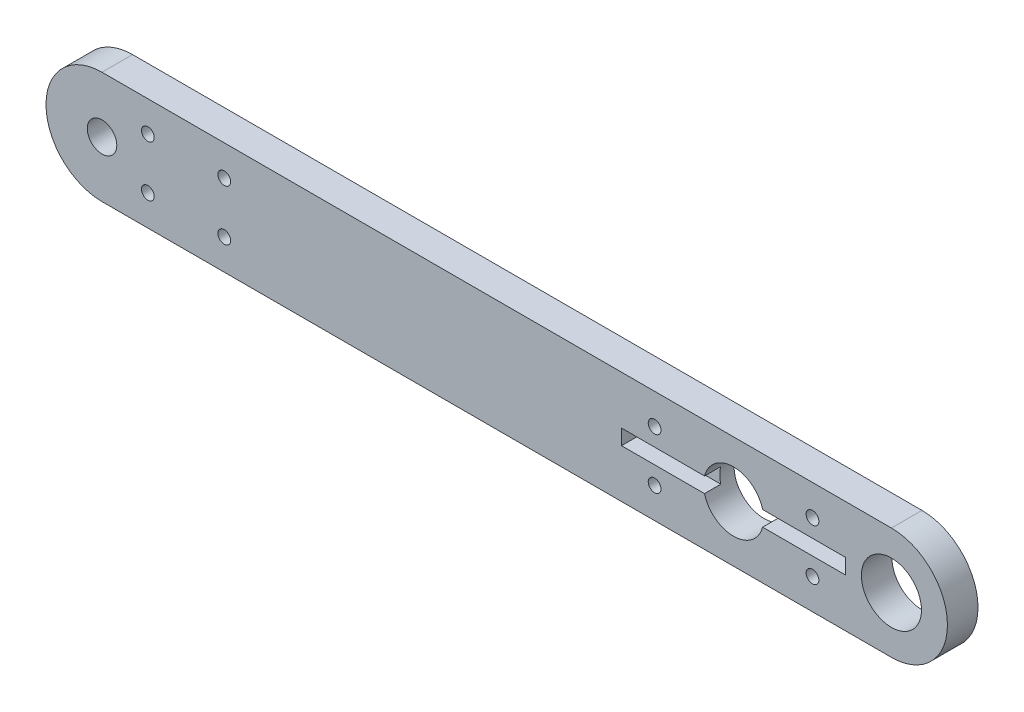
ISO-10303-21;
HEADER;
FILE_DESCRIPTION(('STEP AP214'),'2;1');
FILE_NAME('part.step','',(''),(''),'','','');
FILE_SCHEMA(('AUTOMOTIVE_DESIGN { 1 0 10303 214 1 1 1 1 }'));
ENDSEC;
DATA;
#1=APPLICATION_CONTEXT('core data for automotive mechanical design processes');
#2=APPLICATION_PROTOCOL_DEFINITION('international standard','automotive_design',2000,#1);
#3=PRODUCT_CONTEXT('',#1,'mechanical');
#4=PRODUCT('Part','Part','',(#3));
#5=PRODUCT_RELATED_PRODUCT_CATEGORY('part','',(#4));
#6=PRODUCT_DEFINITION_FORMATION('','',#4);
#7=PRODUCT_DEFINITION_CONTEXT('part definition',#1,'design');
#8=PRODUCT_DEFINITION('design','',#6,#7);
#9=PRODUCT_DEFINITION_SHAPE('','',#8);
#10=(LENGTH_UNIT() NAMED_UNIT(*) SI_UNIT(.MILLI.,.METRE.));
#11=(NAMED_UNIT(*) PLANE_ANGLE_UNIT() SI_UNIT($,.RADIAN.));
#12=(NAMED_UNIT(*) SI_UNIT($,.STERADIAN.) SOLID_ANGLE_UNIT());
#13=UNCERTAINTY_MEASURE_WITH_UNIT(LENGTH_MEASURE(1.E-05),#10,'distance_accuracy_value','');
#14=(GEOMETRIC_REPRESENTATION_CONTEXT(3) GLOBAL_UNCERTAINTY_ASSIGNED_CONTEXT((#13)) GLOBAL_UNIT_ASSIGNED_CONTEXT((#10,
#11,#12)) REPRESENTATION_CONTEXT('',''));
#15=CARTESIAN_POINT('',(0.,0.,0.));
#16=DIRECTION('',(0.,0.,1.));
#17=DIRECTION('',(1.,0.,0.));
#18=AXIS2_PLACEMENT_3D('',#15,#16,#17);
#19=CARTESIAN_POINT('',(15.5,0.,3.));
#20=DIRECTION('',(0.,0.,1.));
#21=DIRECTION('',(1.,0.,0.));
#22=AXIS2_PLACEMENT_3D('',#19,#20,#21);
#23=PLANE('',#22);
#24=DIRECTION('',(-1.,0.,0.));
#25=VECTOR('',#24,1.);
#26=CARTESIAN_POINT('',(-11.,0.75,3.));
#27=LINE('',#26,#25);
#28=CARTESIAN_POINT('',(-2.85306852353742,0.75,3.));
#29=VERTEX_POINT('',#28);
#30=CARTESIAN_POINT('',(-11.,0.75,3.));
#31=VERTEX_POINT('',#30);
#32=EDGE_CURVE('E144',#29,#31,#27,.T.);
#33=ORIENTED_EDGE('',*,*,#32,.F.);
#34=CARTESIAN_POINT('',(0.,0.,3.));
#35=DIRECTION('',(0.,0.,1.));
#36=DIRECTION('',(1.,0.,0.));
#37=AXIS2_PLACEMENT_3D('',#34,#35,#36);
#38=CIRCLE('',#37,2.95);
#39=CARTESIAN_POINT('',(2.85306852353742,0.75,3.));
#40=VERTEX_POINT('',#39);
#41=EDGE_CURVE('E217',#40,#29,#38,.T.);
#42=ORIENTED_EDGE('',*,*,#41,.F.);
#43=CARTESIAN_POINT('',(11.,0.75,3.));
#44=VERTEX_POINT('',#43);
#45=EDGE_CURVE('E142',#44,#40,#27,.T.);
#46=ORIENTED_EDGE('',*,*,#45,.F.);
#47=DIRECTION('',(0.,1.,0.));
#48=VECTOR('',#47,1.);
#49=CARTESIAN_POINT('',(11.,0.75,3.));
#50=LINE('',#49,#48);
#51=CARTESIAN_POINT('',(11.,-0.75,3.));
#52=VERTEX_POINT('',#51);
#53=EDGE_CURVE('E153',#52,#44,#50,.T.);
#54=ORIENTED_EDGE('',*,*,#53,.F.);
#55=DIRECTION('',(1.,0.,0.));
#56=VECTOR('',#55,1.);
#57=CARTESIAN_POINT('',(-11.,-0.75,3.));
#58=LINE('',#57,#56);
#59=CARTESIAN_POINT('',(2.85306852353742,-0.75,3.));
#60=VERTEX_POINT('',#59);
#61=EDGE_CURVE('E150',#60,#52,#58,.T.);
#62=ORIENTED_EDGE('',*,*,#61,.F.);
#63=CARTESIAN_POINT('',(-2.85306852353742,-0.75,3.));
#64=VERTEX_POINT('',#63);
#65=EDGE_CURVE('E221',#64,#60,#38,.T.);
#66=ORIENTED_EDGE('',*,*,#65,.F.);
#67=CARTESIAN_POINT('',(-11.,-0.75,3.));
#68=VERTEX_POINT('',#67);
#69=EDGE_CURVE('E151',#68,#64,#58,.T.);
#70=ORIENTED_EDGE('',*,*,#69,.F.);
#71=DIRECTION('',(0.,-1.,0.));
#72=VECTOR('',#71,1.);
#73=CARTESIAN_POINT('',(-11.,0.75,3.));
#74=LINE('',#73,#72);
#75=EDGE_CURVE('E127',#31,#68,#74,.T.);
#76=ORIENTED_EDGE('',*,*,#75,.F.);
#77=EDGE_LOOP('',(#33,#42,#46,#54,#62,#66,#70,#76));
#78=FACE_BOUND('',#77,.T.);
#79=CARTESIAN_POINT('',(7.75,-2.49999999999999,3.));
#80=DIRECTION('',(0.,0.,1.));
#81=DIRECTION('',(1.,0.,0.));
#82=AXIS2_PLACEMENT_3D('',#79,#80,#81);
#83=CIRCLE('',#82,0.625000000000001);
#84=CARTESIAN_POINT('',(8.375,-2.49999999999999,3.));
#85=VERTEX_POINT('',#84);
#86=EDGE_CURVE('E158',#85,#85,#83,.T.);
#87=ORIENTED_EDGE('',*,*,#86,.F.);
#88=EDGE_LOOP('',(#87));
#89=FACE_BOUND('',#88,.T.);
#90=CARTESIAN_POINT('',(-7.75,-2.49999999999999,3.));
#91=DIRECTION('',(0.,0.,1.));
#92=DIRECTION('',(1.,0.,0.));
#93=AXIS2_PLACEMENT_3D('',#90,#91,#92);
#94=CIRCLE('',#93,0.625);
#95=CARTESIAN_POINT('',(-7.125,-2.49999999999999,3.));
#96=VERTEX_POINT('',#95);
#97=EDGE_CURVE('E168',#96,#96,#94,.T.);
#98=ORIENTED_EDGE('',*,*,#97,.F.);
#99=EDGE_LOOP('',(#98));
#100=FACE_BOUND('',#99,.T.);
#101=CARTESIAN_POINT('',(-57.5,-2.49999999999999,3.));
#102=DIRECTION('',(0.,0.,1.));
#103=DIRECTION('',(1.,0.,0.));
#104=AXIS2_PLACEMENT_3D('',#101,#102,#103);
#105=CIRCLE('',#104,0.625000000000001);
#106=CARTESIAN_POINT('',(-56.875,-2.49999999999999,3.));
#107=VERTEX_POINT('',#106);
#108=EDGE_CURVE('E174',#107,#107,#105,.T.);
#109=ORIENTED_EDGE('',*,*,#108,.F.);
#110=EDGE_LOOP('',(#109));
#111=FACE_BOUND('',#110,.T.);
#112=CARTESIAN_POINT('',(-50.,-2.49999999999999,3.));
#113=DIRECTION('',(0.,0.,1.));
#114=DIRECTION('',(1.,0.,0.));
#115=AXIS2_PLACEMENT_3D('',#112,#113,#114);
#116=CIRCLE('',#115,0.625000000000001);
#117=CARTESIAN_POINT('',(-49.375,-2.49999999999999,3.));
#118=VERTEX_POINT('',#117);
#119=EDGE_CURVE('E180',#118,#118,#116,.T.);
#120=ORIENTED_EDGE('',*,*,#119,.F.);
#121=EDGE_LOOP('',(#120));
#122=FACE_BOUND('',#121,.T.);
#123=CARTESIAN_POINT('',(7.75,2.49999999999999,3.));
#124=DIRECTION('',(0.,0.,1.));
#125=DIRECTION('',(1.,0.,0.));
#126=AXIS2_PLACEMENT_3D('',#123,#124,#125);
#127=CIRCLE('',#126,0.625000000000001);
#128=CARTESIAN_POINT('',(8.375,2.49999999999999,3.));
#129=VERTEX_POINT('',#128);
#130=EDGE_CURVE('E186',#129,#129,#127,.T.);
#131=ORIENTED_EDGE('',*,*,#130,.F.);
#132=EDGE_LOOP('',(#131));
#133=FACE_BOUND('',#132,.T.);
#134=CARTESIAN_POINT('',(-7.75,2.49999999999999,3.));
#135=DIRECTION('',(0.,0.,1.));
#136=DIRECTION('',(1.,0.,0.));
#137=AXIS2_PLACEMENT_3D('',#134,#135,#136);
#138=CIRCLE('',#137,0.625);
#139=CARTESIAN_POINT('',(-7.125,2.49999999999999,3.));
#140=VERTEX_POINT('',#139);
#141=EDGE_CURVE('E192',#140,#140,#138,.T.);
#142=ORIENTED_EDGE('',*,*,#141,.F.);
#143=EDGE_LOOP('',(#142));
#144=FACE_BOUND('',#143,.T.);
#145=CARTESIAN_POINT('',(-57.5,2.49999999999999,3.));
#146=DIRECTION('',(0.,0.,1.));
#147=DIRECTION('',(1.,0.,0.));
#148=AXIS2_PLACEMENT_3D('',#145,#146,#147);
#149=CIRCLE('',#148,0.625000000000001);
#150=CARTESIAN_POINT('',(-56.875,2.49999999999999,3.));
#151=VERTEX_POINT('',#150);
#152=EDGE_CURVE('E198',#151,#151,#149,.T.);
#153=ORIENTED_EDGE('',*,*,#152,.F.);
#154=EDGE_LOOP('',(#153));
#155=FACE_BOUND('',#154,.T.);
#156=CARTESIAN_POINT('',(-50.,2.49999999999999,3.));
#157=DIRECTION('',(0.,0.,1.));
#158=DIRECTION('',(1.,0.,0.));
#159=AXIS2_PLACEMENT_3D('',#156,#157,#158);
#160=CIRCLE('',#159,0.625000000000001);
#161=CARTESIAN_POINT('',(-49.375,2.49999999999999,3.));
#162=VERTEX_POINT('',#161);
#163=EDGE_CURVE('E204',#162,#162,#160,.T.);
#164=ORIENTED_EDGE('',*,*,#163,.F.);
#165=EDGE_LOOP('',(#164));
#166=FACE_BOUND('',#165,.T.);
#167=CARTESIAN_POINT('',(15.5,0.,3.));
#168=DIRECTION('',(0.,0.,1.));
#169=DIRECTION('',(1.,0.,0.));
#170=AXIS2_PLACEMENT_3D('',#167,#168,#169);
#171=CIRCLE('',#170,5.5);
#172=CARTESIAN_POINT('',(15.5,-5.5,3.));
#173=VERTEX_POINT('',#172);
#174=CARTESIAN_POINT('',(15.5,5.5,3.));
#175=VERTEX_POINT('',#174);
#176=EDGE_CURVE('E230',#173,#175,#171,.T.);
#177=ORIENTED_EDGE('',*,*,#176,.T.);
#178=DIRECTION('',(-1.,0.,0.));
#179=VECTOR('',#178,1.);
#180=CARTESIAN_POINT('',(15.5,5.5,3.));
#181=LINE('',#180,#179);
#182=CARTESIAN_POINT('',(-62.,5.49999999999999,3.));
#183=VERTEX_POINT('',#182);
#184=EDGE_CURVE('E233',#175,#183,#181,.T.);
#185=ORIENTED_EDGE('',*,*,#184,.T.);
#186=CARTESIAN_POINT('',(-62.,-4.25440932483312E-13,3.));
#187=DIRECTION('',(0.,0.,1.));
#188=DIRECTION('',(1.,0.,0.));
#189=AXIS2_PLACEMENT_3D('',#186,#187,#188);
#190=CIRCLE('',#189,5.49999999999999);
#191=CARTESIAN_POINT('',(-62.,-5.50000000000041,3.));
#192=VERTEX_POINT('',#191);
#193=EDGE_CURVE('E236',#183,#192,#190,.T.);
#194=ORIENTED_EDGE('',*,*,#193,.T.);
#195=DIRECTION('',(1.,0.,0.));
#196=VECTOR('',#195,1.);
#197=CARTESIAN_POINT('',(-62.,-5.49999999999999,3.));
#198=LINE('',#197,#196);
#199=EDGE_CURVE('E238',#192,#173,#198,.T.);
#200=ORIENTED_EDGE('',*,*,#199,.T.);
#201=EDGE_LOOP('',(#177,#185,#194,#200));
#202=FACE_BOUND('',#201,.T.);
#203=CARTESIAN_POINT('',(-62.,-4.25440932483312E-13,3.));
#204=DIRECTION('',(0.,0.,1.));
#205=DIRECTION('',(1.,0.,0.));
#206=AXIS2_PLACEMENT_3D('',#203,#204,#205);
#207=CIRCLE('',#206,1.45);
#208=CARTESIAN_POINT('',(-60.55,-4.25440932483312E-13,3.));
#209=VERTEX_POINT('',#208);
#210=EDGE_CURVE('E224',#209,#209,#207,.T.);
#211=ORIENTED_EDGE('',*,*,#210,.F.);
#212=EDGE_LOOP('',(#211));
#213=FACE_BOUND('',#212,.T.);
#214=CARTESIAN_POINT('',(15.5,0.,3.));
#215=DIRECTION('',(0.,0.,1.));
#216=DIRECTION('',(1.,0.,0.));
#217=AXIS2_PLACEMENT_3D('',#214,#215,#216);
#218=CIRCLE('',#217,2.95);
#219=CARTESIAN_POINT('',(18.45,0.,3.));
#220=VERTEX_POINT('',#219);
#221=EDGE_CURVE('E211',#220,#220,#218,.T.);
#222=ORIENTED_EDGE('',*,*,#221,.F.);
#223=EDGE_LOOP('',(#222));
#224=FACE_BOUND('',#223,.T.);
#225=ADVANCED_FACE('F32',(#78,#89,#100,#111,#122,#133,#144,#155,#166,#202,#213,#224),#23,.T.);
#226=CARTESIAN_POINT('',(15.5,0.,0.));
#227=DIRECTION('',(0.,0.,1.));
#228=DIRECTION('',(1.,0.,0.));
#229=AXIS2_PLACEMENT_3D('',#226,#227,#228);
#230=PLANE('',#229);
#231=CARTESIAN_POINT('',(7.75,-2.49999999999999,0.));
#232=DIRECTION('',(0.,0.,1.));
#233=DIRECTION('',(1.,0.,0.));
#234=AXIS2_PLACEMENT_3D('',#231,#232,#233);
#235=CIRCLE('',#234,0.624999999999999);
#236=CARTESIAN_POINT('',(8.375,-2.49999999999999,0.));
#237=VERTEX_POINT('',#236);
#238=EDGE_CURVE('E165',#237,#237,#235,.T.);
#239=ORIENTED_EDGE('',*,*,#238,.T.);
#240=EDGE_LOOP('',(#239));
#241=FACE_BOUND('',#240,.T.);
#242=CARTESIAN_POINT('',(-7.75,-2.49999999999999,0.));
#243=DIRECTION('',(0.,0.,1.));
#244=DIRECTION('',(1.,0.,0.));
#245=AXIS2_PLACEMENT_3D('',#242,#243,#244);
#246=CIRCLE('',#245,0.624999999999999);
#247=CARTESIAN_POINT('',(-7.125,-2.49999999999999,0.));
#248=VERTEX_POINT('',#247);
#249=EDGE_CURVE('E171',#248,#248,#246,.T.);
#250=ORIENTED_EDGE('',*,*,#249,.T.);
#251=EDGE_LOOP('',(#250));
#252=FACE_BOUND('',#251,.T.);
#253=CARTESIAN_POINT('',(-57.5,-2.49999999999999,0.));
#254=DIRECTION('',(0.,0.,1.));
#255=DIRECTION('',(1.,0.,0.));
#256=AXIS2_PLACEMENT_3D('',#253,#254,#255);
#257=CIRCLE('',#256,0.625000000000001);
#258=CARTESIAN_POINT('',(-56.875,-2.49999999999999,0.));
#259=VERTEX_POINT('',#258);
#260=EDGE_CURVE('E177',#259,#259,#257,.T.);
#261=ORIENTED_EDGE('',*,*,#260,.T.);
#262=EDGE_LOOP('',(#261));
#263=FACE_BOUND('',#262,.T.);
#264=CARTESIAN_POINT('',(-50.,-2.49999999999999,0.));
#265=DIRECTION('',(0.,0.,1.));
#266=DIRECTION('',(1.,0.,0.));
#267=AXIS2_PLACEMENT_3D('',#264,#265,#266);
#268=CIRCLE('',#267,0.625000000000001);
#269=CARTESIAN_POINT('',(-49.375,-2.49999999999999,0.));
#270=VERTEX_POINT('',#269);
#271=EDGE_CURVE('E183',#270,#270,#268,.T.);
#272=ORIENTED_EDGE('',*,*,#271,.T.);
#273=EDGE_LOOP('',(#272));
#274=FACE_BOUND('',#273,.T.);
#275=CARTESIAN_POINT('',(7.75,2.49999999999999,0.));
#276=DIRECTION('',(0.,0.,1.));
#277=DIRECTION('',(1.,0.,0.));
#278=AXIS2_PLACEMENT_3D('',#275,#276,#277);
#279=CIRCLE('',#278,0.624999999999999);
#280=CARTESIAN_POINT('',(8.375,2.49999999999999,0.));
#281=VERTEX_POINT('',#280);
#282=EDGE_CURVE('E189',#281,#281,#279,.T.);
#283=ORIENTED_EDGE('',*,*,#282,.T.);
#284=EDGE_LOOP('',(#283));
#285=FACE_BOUND('',#284,.T.);
#286=CARTESIAN_POINT('',(-7.75,2.49999999999999,0.));
#287=DIRECTION('',(0.,0.,1.));
#288=DIRECTION('',(1.,0.,0.));
#289=AXIS2_PLACEMENT_3D('',#286,#287,#288);
#290=CIRCLE('',#289,0.624999999999999);
#291=CARTESIAN_POINT('',(-7.125,2.49999999999999,0.));
#292=VERTEX_POINT('',#291);
#293=EDGE_CURVE('E195',#292,#292,#290,.T.);
#294=ORIENTED_EDGE('',*,*,#293,.T.);
#295=EDGE_LOOP('',(#294));
#296=FACE_BOUND('',#295,.T.);
#297=CARTESIAN_POINT('',(-57.5,2.49999999999999,0.));
#298=DIRECTION('',(0.,0.,1.));
#299=DIRECTION('',(1.,0.,0.));
#300=AXIS2_PLACEMENT_3D('',#297,#298,#299);
#301=CIRCLE('',#300,0.625000000000001);
#302=CARTESIAN_POINT('',(-56.875,2.49999999999999,0.));
#303=VERTEX_POINT('',#302);
#304=EDGE_CURVE('E201',#303,#303,#301,.T.);
#305=ORIENTED_EDGE('',*,*,#304,.T.);
#306=EDGE_LOOP('',(#305));
#307=FACE_BOUND('',#306,.T.);
#308=CARTESIAN_POINT('',(-50.,2.49999999999999,0.));
#309=DIRECTION('',(0.,0.,1.));
#310=DIRECTION('',(1.,0.,0.));
#311=AXIS2_PLACEMENT_3D('',#308,#309,#310);
#312=CIRCLE('',#311,0.625000000000001);
#313=CARTESIAN_POINT('',(-49.375,2.49999999999999,0.));
#314=VERTEX_POINT('',#313);
#315=EDGE_CURVE('E207',#314,#314,#312,.T.);
#316=ORIENTED_EDGE('',*,*,#315,.T.);
#317=EDGE_LOOP('',(#316));
#318=FACE_BOUND('',#317,.T.);
#319=CARTESIAN_POINT('',(0.,0.,0.));
#320=DIRECTION('',(0.,0.,1.));
#321=DIRECTION('',(1.,0.,0.));
#322=AXIS2_PLACEMENT_3D('',#319,#320,#321);
#323=CIRCLE('',#322,2.95);
#324=CARTESIAN_POINT('',(2.95,0.,0.));
#325=VERTEX_POINT('',#324);
#326=EDGE_CURVE('E214',#325,#325,#323,.T.);
#327=ORIENTED_EDGE('',*,*,#326,.T.);
#328=EDGE_LOOP('',(#327));
#329=FACE_BOUND('',#328,.T.);
#330=CARTESIAN_POINT('',(15.5,0.,0.));
#331=DIRECTION('',(0.,0.,1.));
#332=DIRECTION('',(1.,0.,0.));
#333=AXIS2_PLACEMENT_3D('',#330,#331,#332);
#334=CIRCLE('',#333,5.5);
#335=CARTESIAN_POINT('',(15.5,-5.5,0.));
#336=VERTEX_POINT('',#335);
#337=CARTESIAN_POINT('',(15.5,5.5,0.));
#338=VERTEX_POINT('',#337);
#339=EDGE_CURVE('E227',#336,#338,#334,.T.);
#340=ORIENTED_EDGE('',*,*,#339,.F.);
#341=DIRECTION('',(1.,0.,0.));
#342=VECTOR('',#341,1.);
#343=CARTESIAN_POINT('',(-62.,-5.49999999999999,0.));
#344=LINE('',#343,#342);
#345=CARTESIAN_POINT('',(-62.,-5.50000000000041,0.));
#346=VERTEX_POINT('',#345);
#347=EDGE_CURVE('E234',#346,#336,#344,.T.);
#348=ORIENTED_EDGE('',*,*,#347,.F.);
#349=CARTESIAN_POINT('',(-62.,-4.25440932483312E-13,0.));
#350=DIRECTION('',(0.,0.,1.));
#351=DIRECTION('',(1.,0.,0.));
#352=AXIS2_PLACEMENT_3D('',#349,#350,#351);
#353=CIRCLE('',#352,5.49999999999999);
#354=CARTESIAN_POINT('',(-62.,5.49999999999999,0.));
#355=VERTEX_POINT('',#354);
#356=EDGE_CURVE('E245',#355,#346,#353,.T.);
#357=ORIENTED_EDGE('',*,*,#356,.F.);
#358=DIRECTION('',(-1.,0.,0.));
#359=VECTOR('',#358,1.);
#360=CARTESIAN_POINT('',(15.5,5.5,0.));
#361=LINE('',#360,#359);
#362=EDGE_CURVE('E243',#338,#355,#361,.T.);
#363=ORIENTED_EDGE('',*,*,#362,.F.);
#364=EDGE_LOOP('',(#340,#348,#357,#363));
#365=FACE_BOUND('',#364,.T.);
#366=CARTESIAN_POINT('',(-62.,-4.25440932483312E-13,0.));
#367=DIRECTION('',(0.,0.,1.));
#368=DIRECTION('',(1.,0.,0.));
#369=AXIS2_PLACEMENT_3D('',#366,#367,#368);
#370=CIRCLE('',#369,1.45);
#371=CARTESIAN_POINT('',(-60.55,-4.25440932483312E-13,0.));
#372=VERTEX_POINT('',#371);
#373=EDGE_CURVE('E220',#372,#372,#370,.T.);
#374=ORIENTED_EDGE('',*,*,#373,.T.);
#375=EDGE_LOOP('',(#374));
#376=FACE_BOUND('',#375,.T.);
#377=CARTESIAN_POINT('',(15.5,0.,0.));
#378=DIRECTION('',(0.,0.,1.));
#379=DIRECTION('',(1.,0.,0.));
#380=AXIS2_PLACEMENT_3D('',#377,#378,#379);
#381=CIRCLE('',#380,2.95);
#382=CARTESIAN_POINT('',(18.45,0.,0.));
#383=VERTEX_POINT('',#382);
#384=EDGE_CURVE('E210',#383,#383,#381,.T.);
#385=ORIENTED_EDGE('',*,*,#384,.T.);
#386=EDGE_LOOP('',(#385));
#387=FACE_BOUND('',#386,.T.);
#388=ADVANCED_FACE('F302',(#241,#252,#263,#274,#285,#296,#307,#318,#329,#365,#376,#387),#230,.F.);
#389=CARTESIAN_POINT('',(15.5,0.,3.));
#390=DIRECTION('',(0.,0.,-1.));
#391=DIRECTION('',(-1.,0.,0.));
#392=AXIS2_PLACEMENT_3D('',#389,#390,#391);
#393=CYLINDRICAL_SURFACE('',#392,5.5);
#394=ORIENTED_EDGE('',*,*,#339,.T.);
#395=DIRECTION('',(0.,0.,-1.));
#396=VECTOR('',#395,1.);
#397=CARTESIAN_POINT('',(15.5,5.5,3.));
#398=LINE('',#397,#396);
#399=EDGE_CURVE('E256',#175,#338,#398,.T.);
#400=ORIENTED_EDGE('',*,*,#399,.F.);
#401=ORIENTED_EDGE('',*,*,#176,.F.);
#402=DIRECTION('',(0.,0.,-1.));
#403=VECTOR('',#402,1.);
#404=CARTESIAN_POINT('',(15.5,-5.5,3.));
#405=LINE('',#404,#403);
#406=EDGE_CURVE('E240',#173,#336,#405,.T.);
#407=ORIENTED_EDGE('',*,*,#406,.T.);
#408=EDGE_LOOP('',(#394,#400,#401,#407));
#409=FACE_BOUND('',#408,.T.);
#410=ADVANCED_FACE('F34',(#409),#393,.T.);
#411=CARTESIAN_POINT('',(15.5,5.5,3.));
#412=DIRECTION('',(0.,-1.,0.));
#413=DIRECTION('',(1.,0.,0.));
#414=AXIS2_PLACEMENT_3D('',#411,#412,#413);
#415=PLANE('',#414);
#416=ORIENTED_EDGE('',*,*,#362,.T.);
#417=DIRECTION('',(0.,0.,-1.));
#418=VECTOR('',#417,1.);
#419=CARTESIAN_POINT('',(-62.,5.49999999999999,3.));
#420=LINE('',#419,#418);
#421=EDGE_CURVE('E253',#183,#355,#420,.T.);
#422=ORIENTED_EDGE('',*,*,#421,.F.);
#423=ORIENTED_EDGE('',*,*,#184,.F.);
#424=ORIENTED_EDGE('',*,*,#399,.T.);
#425=EDGE_LOOP('',(#416,#422,#423,#424));
#426=FACE_BOUND('',#425,.T.);
#427=ADVANCED_FACE('F319',(#426),#415,.F.);
#428=CARTESIAN_POINT('',(-62.,-4.25440932483312E-13,3.));
#429=DIRECTION('',(0.,0.,-1.));
#430=DIRECTION('',(-1.,0.,0.));
#431=AXIS2_PLACEMENT_3D('',#428,#429,#430);
#432=CYLINDRICAL_SURFACE('',#431,5.49999999999999);
#433=ORIENTED_EDGE('',*,*,#356,.T.);
#434=DIRECTION('',(0.,0.,-1.));
#435=VECTOR('',#434,1.);
#436=CARTESIAN_POINT('',(-62.,-5.50000000000041,3.));
#437=LINE('',#436,#435);
#438=EDGE_CURVE('E250',#192,#346,#437,.T.);
#439=ORIENTED_EDGE('',*,*,#438,.F.);
#440=ORIENTED_EDGE('',*,*,#193,.F.);
#441=ORIENTED_EDGE('',*,*,#421,.T.);
#442=EDGE_LOOP('',(#433,#439,#440,#441));
#443=FACE_BOUND('',#442,.T.);
#444=ADVANCED_FACE('F316',(#443),#432,.T.);
#445=CARTESIAN_POINT('',(-62.,-5.49999999999999,3.));
#446=DIRECTION('',(0.,1.,0.));
#447=DIRECTION('',(-1.,0.,0.));
#448=AXIS2_PLACEMENT_3D('',#445,#446,#447);
#449=PLANE('',#448);
#450=ORIENTED_EDGE('',*,*,#347,.T.);
#451=ORIENTED_EDGE('',*,*,#406,.F.);
#452=ORIENTED_EDGE('',*,*,#199,.F.);
#453=ORIENTED_EDGE('',*,*,#438,.T.);
#454=EDGE_LOOP('',(#450,#451,#452,#453));
#455=FACE_BOUND('',#454,.T.);
#456=ADVANCED_FACE('F313',(#455),#449,.F.);
#457=CARTESIAN_POINT('',(-62.,-4.25440932483312E-13,3.));
#458=DIRECTION('',(0.,0.,-1.));
#459=DIRECTION('',(-1.,0.,0.));
#460=AXIS2_PLACEMENT_3D('',#457,#458,#459);
#461=CYLINDRICAL_SURFACE('',#460,1.45);
#462=ORIENTED_EDGE('',*,*,#210,.T.);
#463=EDGE_LOOP('',(#462));
#464=FACE_BOUND('',#463,.T.);
#465=ORIENTED_EDGE('',*,*,#373,.F.);
#466=EDGE_LOOP('',(#465));
#467=FACE_BOUND('',#466,.T.);
#468=ADVANCED_FACE('F310',(#464,#467),#461,.F.);
#469=CARTESIAN_POINT('',(0.,0.,3.));
#470=DIRECTION('',(0.,0.,-1.));
#471=DIRECTION('',(-1.,0.,0.));
#472=AXIS2_PLACEMENT_3D('',#469,#470,#471);
#473=CYLINDRICAL_SURFACE('',#472,2.95);
#474=DIRECTION('',(0.,0.,-1.));
#475=VECTOR('',#474,1.);
#476=CARTESIAN_POINT('',(-2.85306852353742,0.75,3.));
#477=LINE('',#476,#475);
#478=CARTESIAN_POINT('',(-2.85306852353742,0.75,1.4));
#479=VERTEX_POINT('',#478);
#480=EDGE_CURVE('E11',#479,#29,#477,.F.);
#481=ORIENTED_EDGE('',*,*,#480,.F.);
#482=CARTESIAN_POINT('',(0.,0.,1.4));
#483=DIRECTION('',(0.,0.,1.));
#484=DIRECTION('',(1.,0.,0.));
#485=AXIS2_PLACEMENT_3D('',#482,#483,#484);
#486=CIRCLE('',#485,2.95);
#487=CARTESIAN_POINT('',(-2.85306852353742,-0.75,1.4));
#488=VERTEX_POINT('',#487);
#489=EDGE_CURVE('E263',#479,#488,#486,.T.);
#490=ORIENTED_EDGE('',*,*,#489,.T.);
#491=DIRECTION('',(0.,0.,-1.));
#492=VECTOR('',#491,1.);
#493=CARTESIAN_POINT('',(-2.85306852353742,-0.75,3.));
#494=LINE('',#493,#492);
#495=EDGE_CURVE('E40',#64,#488,#494,.T.);
#496=ORIENTED_EDGE('',*,*,#495,.F.);
#497=ORIENTED_EDGE('',*,*,#65,.T.);
#498=DIRECTION('',(0.,0.,-1.));
#499=VECTOR('',#498,1.);
#500=CARTESIAN_POINT('',(2.85306852353742,-0.75,3.));
#501=LINE('',#500,#499);
#502=CARTESIAN_POINT('',(2.85306852353742,-0.75,1.4));
#503=VERTEX_POINT('',#502);
#504=EDGE_CURVE('E262',#503,#60,#501,.F.);
#505=ORIENTED_EDGE('',*,*,#504,.F.);
#506=CARTESIAN_POINT('',(2.85306852353742,0.75,1.4));
#507=VERTEX_POINT('',#506);
#508=EDGE_CURVE('E259',#503,#507,#486,.T.);
#509=ORIENTED_EDGE('',*,*,#508,.T.);
#510=DIRECTION('',(0.,0.,-1.));
#511=VECTOR('',#510,1.);
#512=CARTESIAN_POINT('',(2.85306852353742,0.75,3.));
#513=LINE('',#512,#511);
#514=EDGE_CURVE('E265',#40,#507,#513,.T.);
#515=ORIENTED_EDGE('',*,*,#514,.F.);
#516=ORIENTED_EDGE('',*,*,#41,.T.);
#517=EDGE_LOOP('',(#481,#490,#496,#497,#505,#509,#515,#516));
#518=FACE_BOUND('',#517,.T.);
#519=ORIENTED_EDGE('',*,*,#326,.F.);
#520=EDGE_LOOP('',(#519));
#521=FACE_BOUND('',#520,.T.);
#522=ADVANCED_FACE('F268',(#518,#521),#473,.F.);
#523=CARTESIAN_POINT('',(15.5,0.,3.));
#524=DIRECTION('',(0.,0.,-1.));
#525=DIRECTION('',(-1.,0.,0.));
#526=AXIS2_PLACEMENT_3D('',#523,#524,#525);
#527=CYLINDRICAL_SURFACE('',#526,2.95);
#528=ORIENTED_EDGE('',*,*,#221,.T.);
#529=EDGE_LOOP('',(#528));
#530=FACE_BOUND('',#529,.T.);
#531=ORIENTED_EDGE('',*,*,#384,.F.);
#532=EDGE_LOOP('',(#531));
#533=FACE_BOUND('',#532,.T.);
#534=ADVANCED_FACE('F345',(#530,#533),#527,.F.);
#535=CARTESIAN_POINT('',(-50.,2.49999999999999,3.));
#536=DIRECTION('',(0.,0.,1.));
#537=DIRECTION('',(1.,0.,0.));
#538=AXIS2_PLACEMENT_3D('',#535,#536,#537);
#539=CYLINDRICAL_SURFACE('',#538,0.625000000000001);
#540=ORIENTED_EDGE('',*,*,#315,.F.);
#541=EDGE_LOOP('',(#540));
#542=FACE_BOUND('',#541,.T.);
#543=ORIENTED_EDGE('',*,*,#163,.T.);
#544=EDGE_LOOP('',(#543));
#545=FACE_BOUND('',#544,.T.);
#546=ADVANCED_FACE('F348',(#542,#545),#539,.F.);
#547=CARTESIAN_POINT('',(-57.5,2.49999999999999,3.));
#548=DIRECTION('',(0.,0.,1.));
#549=DIRECTION('',(1.,0.,0.));
#550=AXIS2_PLACEMENT_3D('',#547,#548,#549);
#551=CYLINDRICAL_SURFACE('',#550,0.625000000000001);
#552=ORIENTED_EDGE('',*,*,#304,.F.);
#553=EDGE_LOOP('',(#552));
#554=FACE_BOUND('',#553,.T.);
#555=ORIENTED_EDGE('',*,*,#152,.T.);
#556=EDGE_LOOP('',(#555));
#557=FACE_BOUND('',#556,.T.);
#558=ADVANCED_FACE('F356',(#554,#557),#551,.F.);
#559=CARTESIAN_POINT('',(-7.75,2.49999999999999,3.));
#560=DIRECTION('',(0.,0.,1.));
#561=DIRECTION('',(1.,0.,0.));
#562=AXIS2_PLACEMENT_3D('',#559,#560,#561);
#563=CYLINDRICAL_SURFACE('',#562,0.624999999999999);
#564=ORIENTED_EDGE('',*,*,#293,.F.);
#565=EDGE_LOOP('',(#564));
#566=FACE_BOUND('',#565,.T.);
#567=ORIENTED_EDGE('',*,*,#141,.T.);
#568=EDGE_LOOP('',(#567));
#569=FACE_BOUND('',#568,.T.);
#570=ADVANCED_FACE('F362',(#566,#569),#563,.F.);
#571=CARTESIAN_POINT('',(7.75,2.49999999999999,3.));
#572=DIRECTION('',(0.,0.,1.));
#573=DIRECTION('',(1.,0.,0.));
#574=AXIS2_PLACEMENT_3D('',#571,#572,#573);
#575=CYLINDRICAL_SURFACE('',#574,0.625);
#576=ORIENTED_EDGE('',*,*,#282,.F.);
#577=EDGE_LOOP('',(#576));
#578=FACE_BOUND('',#577,.T.);
#579=ORIENTED_EDGE('',*,*,#130,.T.);
#580=EDGE_LOOP('',(#579));
#581=FACE_BOUND('',#580,.T.);
#582=ADVANCED_FACE('F366',(#578,#581),#575,.F.);
#583=CARTESIAN_POINT('',(-50.,-2.49999999999999,3.));
#584=DIRECTION('',(0.,0.,1.));
#585=DIRECTION('',(1.,0.,0.));
#586=AXIS2_PLACEMENT_3D('',#583,#584,#585);
#587=CYLINDRICAL_SURFACE('',#586,0.625000000000001);
#588=ORIENTED_EDGE('',*,*,#271,.F.);
#589=EDGE_LOOP('',(#588));
#590=FACE_BOUND('',#589,.T.);
#591=ORIENTED_EDGE('',*,*,#119,.T.);
#592=EDGE_LOOP('',(#591));
#593=FACE_BOUND('',#592,.T.);
#594=ADVANCED_FACE('F370',(#590,#593),#587,.F.);
#595=CARTESIAN_POINT('',(-57.5,-2.49999999999999,3.));
#596=DIRECTION('',(0.,0.,1.));
#597=DIRECTION('',(1.,0.,0.));
#598=AXIS2_PLACEMENT_3D('',#595,#596,#597);
#599=CYLINDRICAL_SURFACE('',#598,0.625000000000001);
#600=ORIENTED_EDGE('',*,*,#260,.F.);
#601=EDGE_LOOP('',(#600));
#602=FACE_BOUND('',#601,.T.);
#603=ORIENTED_EDGE('',*,*,#108,.T.);
#604=EDGE_LOOP('',(#603));
#605=FACE_BOUND('',#604,.T.);
#606=ADVANCED_FACE('F374',(#602,#605),#599,.F.);
#607=CARTESIAN_POINT('',(-7.75,-2.49999999999999,3.));
#608=DIRECTION('',(0.,0.,1.));
#609=DIRECTION('',(1.,0.,0.));
#610=AXIS2_PLACEMENT_3D('',#607,#608,#609);
#611=CYLINDRICAL_SURFACE('',#610,0.624999999999999);
#612=ORIENTED_EDGE('',*,*,#249,.F.);
#613=EDGE_LOOP('',(#612));
#614=FACE_BOUND('',#613,.T.);
#615=ORIENTED_EDGE('',*,*,#97,.T.);
#616=EDGE_LOOP('',(#615));
#617=FACE_BOUND('',#616,.T.);
#618=ADVANCED_FACE('F378',(#614,#617),#611,.F.);
#619=CARTESIAN_POINT('',(7.75,-2.49999999999999,3.));
#620=DIRECTION('',(0.,0.,1.));
#621=DIRECTION('',(1.,0.,0.));
#622=AXIS2_PLACEMENT_3D('',#619,#620,#621);
#623=CYLINDRICAL_SURFACE('',#622,0.625);
#624=ORIENTED_EDGE('',*,*,#238,.F.);
#625=EDGE_LOOP('',(#624));
#626=FACE_BOUND('',#625,.T.);
#627=ORIENTED_EDGE('',*,*,#86,.T.);
#628=EDGE_LOOP('',(#627));
#629=FACE_BOUND('',#628,.T.);
#630=ADVANCED_FACE('F382',(#626,#629),#623,.F.);
#631=CARTESIAN_POINT('',(0.,0.,1.4));
#632=DIRECTION('',(0.,0.,1.));
#633=DIRECTION('',(1.,0.,0.));
#634=AXIS2_PLACEMENT_3D('',#631,#632,#633);
#635=PLANE('',#634);
#636=DIRECTION('',(1.,0.,0.));
#637=VECTOR('',#636,1.);
#638=CARTESIAN_POINT('',(-11.,-0.75,1.4));
#639=LINE('',#638,#637);
#640=CARTESIAN_POINT('',(11.,-0.75,1.4));
#641=VERTEX_POINT('',#640);
#642=EDGE_CURVE('E136',#503,#641,#639,.T.);
#643=ORIENTED_EDGE('',*,*,#642,.T.);
#644=DIRECTION('',(0.,1.,0.));
#645=VECTOR('',#644,1.);
#646=CARTESIAN_POINT('',(11.,0.75,1.4));
#647=LINE('',#646,#645);
#648=CARTESIAN_POINT('',(11.,0.75,1.4));
#649=VERTEX_POINT('',#648);
#650=EDGE_CURVE('E135',#641,#649,#647,.T.);
#651=ORIENTED_EDGE('',*,*,#650,.T.);
#652=DIRECTION('',(-1.,0.,0.));
#653=VECTOR('',#652,1.);
#654=CARTESIAN_POINT('',(-11.,0.75,1.4));
#655=LINE('',#654,#653);
#656=EDGE_CURVE('E55',#649,#507,#655,.T.);
#657=ORIENTED_EDGE('',*,*,#656,.T.);
#658=ORIENTED_EDGE('',*,*,#508,.F.);
#659=EDGE_LOOP('',(#643,#651,#657,#658));
#660=FACE_BOUND('',#659,.T.);
#661=ADVANCED_FACE('F287',(#660),#635,.T.);
#662=CARTESIAN_POINT('',(-11.,-0.75,1.4));
#663=DIRECTION('',(0.,-1.,0.));
#664=DIRECTION('',(0.,0.,-1.));
#665=AXIS2_PLACEMENT_3D('',#662,#663,#664);
#666=PLANE('',#665);
#667=ORIENTED_EDGE('',*,*,#504,.T.);
#668=ORIENTED_EDGE('',*,*,#61,.T.);
#669=DIRECTION('',(0.,0.,1.));
#670=VECTOR('',#669,1.);
#671=CARTESIAN_POINT('',(11.,-0.75,1.4));
#672=LINE('',#671,#670);
#673=EDGE_CURVE('E130',#641,#52,#672,.T.);
#674=ORIENTED_EDGE('',*,*,#673,.F.);
#675=ORIENTED_EDGE('',*,*,#642,.F.);
#676=EDGE_LOOP('',(#667,#668,#674,#675));
#677=FACE_BOUND('',#676,.T.);
#678=ADVANCED_FACE('F284',(#677),#666,.F.);
#679=CARTESIAN_POINT('',(-11.,0.75,1.4));
#680=DIRECTION('',(0.,1.,0.));
#681=DIRECTION('',(0.,0.,1.));
#682=AXIS2_PLACEMENT_3D('',#679,#680,#681);
#683=PLANE('',#682);
#684=ORIENTED_EDGE('',*,*,#514,.T.);
#685=ORIENTED_EDGE('',*,*,#656,.F.);
#686=DIRECTION('',(0.,0.,1.));
#687=VECTOR('',#686,1.);
#688=CARTESIAN_POINT('',(11.,0.75,1.4));
#689=LINE('',#688,#687);
#690=EDGE_CURVE('E159',#649,#44,#689,.T.);
#691=ORIENTED_EDGE('',*,*,#690,.T.);
#692=ORIENTED_EDGE('',*,*,#45,.T.);
#693=EDGE_LOOP('',(#684,#685,#691,#692));
#694=FACE_BOUND('',#693,.T.);
#695=ADVANCED_FACE('F290',(#694),#683,.F.);
#696=CARTESIAN_POINT('',(11.,0.75,1.4));
#697=DIRECTION('',(1.,0.,0.));
#698=DIRECTION('',(0.,1.,0.));
#699=AXIS2_PLACEMENT_3D('',#696,#697,#698);
#700=PLANE('',#699);
#701=ORIENTED_EDGE('',*,*,#53,.T.);
#702=ORIENTED_EDGE('',*,*,#690,.F.);
#703=ORIENTED_EDGE('',*,*,#650,.F.);
#704=ORIENTED_EDGE('',*,*,#673,.T.);
#705=EDGE_LOOP('',(#701,#702,#703,#704));
#706=FACE_BOUND('',#705,.T.);
#707=ADVANCED_FACE('F292',(#706),#700,.F.);
#708=ORIENTED_EDGE('',*,*,#495,.T.);
#709=CARTESIAN_POINT('',(-11.,-0.75,1.4));
#710=VERTEX_POINT('',#709);
#711=EDGE_CURVE('E47',#710,#488,#639,.T.);
#712=ORIENTED_EDGE('',*,*,#711,.F.);
#713=DIRECTION('',(0.,0.,1.));
#714=VECTOR('',#713,1.);
#715=CARTESIAN_POINT('',(-11.,-0.75,1.4));
#716=LINE('',#715,#714);
#717=EDGE_CURVE('E122',#710,#68,#716,.T.);
#718=ORIENTED_EDGE('',*,*,#717,.T.);
#719=ORIENTED_EDGE('',*,*,#69,.T.);
#720=EDGE_LOOP('',(#708,#712,#718,#719));
#721=FACE_BOUND('',#720,.T.);
#722=ADVANCED_FACE('F132',(#721),#666,.F.);
#723=CARTESIAN_POINT('',(-11.,0.75,1.4));
#724=VERTEX_POINT('',#723);
#725=EDGE_CURVE('E140',#479,#724,#655,.T.);
#726=ORIENTED_EDGE('',*,*,#725,.T.);
#727=DIRECTION('',(0.,-1.,0.));
#728=VECTOR('',#727,1.);
#729=CARTESIAN_POINT('',(-11.,0.75,1.4));
#730=LINE('',#729,#728);
#731=EDGE_CURVE('E125',#724,#710,#730,.T.);
#732=ORIENTED_EDGE('',*,*,#731,.T.);
#733=ORIENTED_EDGE('',*,*,#711,.T.);
#734=ORIENTED_EDGE('',*,*,#489,.F.);
#735=EDGE_LOOP('',(#726,#732,#733,#734));
#736=FACE_BOUND('',#735,.T.);
#737=ADVANCED_FACE('F138',(#736),#635,.T.);
#738=CARTESIAN_POINT('',(-11.,0.75,1.4));
#739=DIRECTION('',(-1.,0.,0.));
#740=DIRECTION('',(0.,-1.,0.));
#741=AXIS2_PLACEMENT_3D('',#738,#739,#740);
#742=PLANE('',#741);
#743=ORIENTED_EDGE('',*,*,#75,.T.);
#744=ORIENTED_EDGE('',*,*,#717,.F.);
#745=ORIENTED_EDGE('',*,*,#731,.F.);
#746=DIRECTION('',(0.,0.,1.));
#747=VECTOR('',#746,1.);
#748=CARTESIAN_POINT('',(-11.,0.75,1.4));
#749=LINE('',#748,#747);
#750=EDGE_CURVE('E156',#724,#31,#749,.T.);
#751=ORIENTED_EDGE('',*,*,#750,.T.);
#752=EDGE_LOOP('',(#743,#744,#745,#751));
#753=FACE_BOUND('',#752,.T.);
#754=ADVANCED_FACE('F123',(#753),#742,.F.);
#755=ORIENTED_EDGE('',*,*,#480,.T.);
#756=ORIENTED_EDGE('',*,*,#32,.T.);
#757=ORIENTED_EDGE('',*,*,#750,.F.);
#758=ORIENTED_EDGE('',*,*,#725,.F.);
#759=EDGE_LOOP('',(#755,#756,#757,#758));
#760=FACE_BOUND('',#759,.T.);
#761=ADVANCED_FACE('F273',(#760),#683,.F.);
#762=CLOSED_SHELL('',(#225,#388,#410,#427,#444,#456,#468,#522,#534,#546,#558,#570,#582,#594,
#606,#618,#630,#661,#678,#695,#707,#722,#737,#754,#761));
#763=MANIFOLD_SOLID_BREP('B2',#762);
#764=ADVANCED_BREP_SHAPE_REPRESENTATION('',(#18,#763),#14);
#765=SHAPE_DEFINITION_REPRESENTATION(#9,#764);
ENDSEC;
END-ISO-10303-21;
